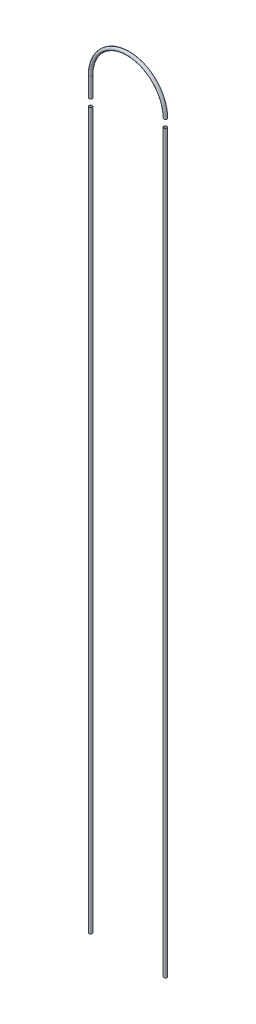
ISO-10303-21;
HEADER;
FILE_DESCRIPTION(('STEP AP214'),'2;1');
FILE_NAME('part.step','',(''),(''),'','','');
FILE_SCHEMA(('AUTOMOTIVE_DESIGN { 1 0 10303 214 1 1 1 1 }'));
ENDSEC;
DATA;
#1=APPLICATION_CONTEXT('core data for automotive mechanical design processes');
#2=APPLICATION_PROTOCOL_DEFINITION('international standard','automotive_design',2000,#1);
#3=PRODUCT_CONTEXT('',#1,'mechanical');
#4=PRODUCT('Part','Part','',(#3));
#5=PRODUCT_RELATED_PRODUCT_CATEGORY('part','',(#4));
#6=PRODUCT_DEFINITION_FORMATION('','',#4);
#7=PRODUCT_DEFINITION_CONTEXT('part definition',#1,'design');
#8=PRODUCT_DEFINITION('design','',#6,#7);
#9=PRODUCT_DEFINITION_SHAPE('','',#8);
#10=(LENGTH_UNIT() NAMED_UNIT(*) SI_UNIT(.MILLI.,.METRE.));
#11=(NAMED_UNIT(*) PLANE_ANGLE_UNIT() SI_UNIT($,.RADIAN.));
#12=(NAMED_UNIT(*) SI_UNIT($,.STERADIAN.) SOLID_ANGLE_UNIT());
#13=UNCERTAINTY_MEASURE_WITH_UNIT(LENGTH_MEASURE(1.E-05),#10,'distance_accuracy_value','');
#14=(GEOMETRIC_REPRESENTATION_CONTEXT(3) GLOBAL_UNCERTAINTY_ASSIGNED_CONTEXT((#13)) GLOBAL_UNIT_ASSIGNED_CONTEXT((#10,
#11,#12)) REPRESENTATION_CONTEXT('',''));
#15=CARTESIAN_POINT('',(0.,0.,0.));
#16=DIRECTION('',(0.,0.,1.));
#17=DIRECTION('',(1.,0.,0.));
#18=AXIS2_PLACEMENT_3D('',#15,#16,#17);
#19=CARTESIAN_POINT('',(-23039.4013918719,11026.3486481047,40208.3753071264));
#20=DIRECTION('',(0.,-1.,0.));
#21=DIRECTION('',(0.,0.,-1.));
#22=AXIS2_PLACEMENT_3D('',#19,#20,#21);
#23=PLANE('',#22);
#24=CARTESIAN_POINT('',(-23039.4013918719,11026.3486481047,40208.3753071264));
#25=DIRECTION('',(0.,-1.,0.));
#26=DIRECTION('',(0.,0.,-1.));
#27=AXIS2_PLACEMENT_3D('',#24,#25,#26);
#28=CIRCLE('',#27,27.0000000000011);
#29=CARTESIAN_POINT('',(-23039.4013918719,11026.3486481047,40181.3753071264));
#30=VERTEX_POINT('',#29);
#31=EDGE_CURVE('E82',#30,#30,#28,.T.);
#32=ORIENTED_EDGE('',*,*,#31,.T.);
#33=EDGE_LOOP('',(#32));
#34=FACE_BOUND('',#33,.T.);
#35=CARTESIAN_POINT('',(-23039.4013918719,11026.3486481047,40208.3753071264));
#36=DIRECTION('',(0.,-1.,0.));
#37=DIRECTION('',(0.,0.,-1.));
#38=AXIS2_PLACEMENT_3D('',#35,#36,#37);
#39=CIRCLE('',#38,30.0000000000011);
#40=CARTESIAN_POINT('',(-23039.4013918719,11026.3486481047,40178.3753071264));
#41=VERTEX_POINT('',#40);
#42=EDGE_CURVE('E74',#41,#41,#39,.T.);
#43=ORIENTED_EDGE('',*,*,#42,.F.);
#44=EDGE_LOOP('',(#43));
#45=FACE_BOUND('',#44,.T.);
#46=ADVANCED_FACE('F68',(#34,#45),#23,.F.);
#47=CARTESIAN_POINT('',(-23039.4013918719,-2173.6513518953,40208.3753071264));
#48=DIRECTION('',(0.,-1.,0.));
#49=DIRECTION('',(0.,0.,-1.));
#50=AXIS2_PLACEMENT_3D('',#47,#48,#49);
#51=PLANE('',#50);
#52=CARTESIAN_POINT('',(-23039.4013918719,-2173.6513518953,40208.3753071264));
#53=DIRECTION('',(0.,-1.,0.));
#54=DIRECTION('',(0.,0.,-1.));
#55=AXIS2_PLACEMENT_3D('',#52,#53,#54);
#56=CIRCLE('',#55,27.0000000000011);
#57=CARTESIAN_POINT('',(-23039.4013918719,-2173.6513518953,40181.3753071264));
#58=VERTEX_POINT('',#57);
#59=EDGE_CURVE('E78',#58,#58,#56,.T.);
#60=ORIENTED_EDGE('',*,*,#59,.F.);
#61=EDGE_LOOP('',(#60));
#62=FACE_BOUND('',#61,.T.);
#63=CARTESIAN_POINT('',(-23039.4013918719,-2173.6513518953,40208.3753071264));
#64=DIRECTION('',(0.,-1.,0.));
#65=DIRECTION('',(0.,0.,-1.));
#66=AXIS2_PLACEMENT_3D('',#63,#64,#65);
#67=CIRCLE('',#66,30.0000000000011);
#68=CARTESIAN_POINT('',(-23039.4013918719,-2173.6513518953,40178.3753071264));
#69=VERTEX_POINT('',#68);
#70=EDGE_CURVE('E12',#69,#69,#67,.T.);
#71=ORIENTED_EDGE('',*,*,#70,.T.);
#72=EDGE_LOOP('',(#71));
#73=FACE_BOUND('',#72,.T.);
#74=ADVANCED_FACE('F98',(#62,#73),#51,.T.);
#75=CARTESIAN_POINT('',(-23039.4013918719,11026.3486481047,40208.3753071264));
#76=DIRECTION('',(0.,-1.,0.));
#77=DIRECTION('',(0.,0.,-1.));
#78=AXIS2_PLACEMENT_3D('',#75,#76,#77);
#79=CYLINDRICAL_SURFACE('',#78,30.0000000000011);
#80=ORIENTED_EDGE('',*,*,#70,.F.);
#81=EDGE_LOOP('',(#80));
#82=FACE_BOUND('',#81,.T.);
#83=ORIENTED_EDGE('',*,*,#42,.T.);
#84=EDGE_LOOP('',(#83));
#85=FACE_BOUND('',#84,.T.);
#86=ADVANCED_FACE('F92',(#82,#85),#79,.T.);
#87=CARTESIAN_POINT('',(-23039.4013918719,11026.3486481047,40208.3753071264));
#88=DIRECTION('',(0.,-1.,0.));
#89=DIRECTION('',(0.,0.,-1.));
#90=AXIS2_PLACEMENT_3D('',#87,#88,#89);
#91=CYLINDRICAL_SURFACE('',#90,27.0000000000011);
#92=ORIENTED_EDGE('',*,*,#59,.T.);
#93=EDGE_LOOP('',(#92));
#94=FACE_BOUND('',#93,.T.);
#95=ORIENTED_EDGE('',*,*,#31,.F.);
#96=EDGE_LOOP('',(#95));
#97=FACE_BOUND('',#96,.T.);
#98=ADVANCED_FACE('F90',(#94,#97),#91,.F.);
#99=CLOSED_SHELL('',(#46,#74,#86,#98));
#100=MANIFOLD_SOLID_BREP('B2',#99);
#101=CARTESIAN_POINT('',(-21659.4013918008,11384.9457116641,40208.3753150977));
#102=DIRECTION('',(0.,-1.,0.));
#103=DIRECTION('',(0.,0.,-1.));
#104=AXIS2_PLACEMENT_3D('',#101,#102,#103);
#105=PLANE('',#104);
#106=CARTESIAN_POINT('',(-21659.4013918008,11384.9457116641,40208.3753150977));
#107=DIRECTION('',(0.,-1.,0.));
#108=DIRECTION('',(0.,0.,-1.));
#109=AXIS2_PLACEMENT_3D('',#106,#107,#108);
#110=CIRCLE('',#109,27.0000000000011);
#111=CARTESIAN_POINT('',(-21659.4013918008,11384.9457116641,40181.3753150977));
#112=VERTEX_POINT('',#111);
#113=EDGE_CURVE('E159',#112,#112,#110,.T.);
#114=ORIENTED_EDGE('',*,*,#113,.T.);
#115=EDGE_LOOP('',(#114));
#116=FACE_BOUND('',#115,.T.);
#117=CARTESIAN_POINT('',(-21659.4013918008,11384.9457116641,40208.3753150977));
#118=DIRECTION('',(0.,-1.,0.));
#119=DIRECTION('',(0.,0.,-1.));
#120=AXIS2_PLACEMENT_3D('',#117,#118,#119);
#121=CIRCLE('',#120,30.0000000000011);
#122=CARTESIAN_POINT('',(-21659.4013918008,11384.9457116641,40178.3753150977));
#123=VERTEX_POINT('',#122);
#124=EDGE_CURVE('E151',#123,#123,#121,.T.);
#125=ORIENTED_EDGE('',*,*,#124,.F.);
#126=EDGE_LOOP('',(#125));
#127=FACE_BOUND('',#126,.T.);
#128=ADVANCED_FACE('F145',(#116,#127),#105,.F.);
#129=CARTESIAN_POINT('',(-21659.4013918008,-2185.05428833593,40208.3753150977));
#130=DIRECTION('',(0.,-1.,0.));
#131=DIRECTION('',(0.,0.,-1.));
#132=AXIS2_PLACEMENT_3D('',#129,#130,#131);
#133=PLANE('',#132);
#134=CARTESIAN_POINT('',(-21659.4013918008,-2185.05428833593,40208.3753150977));
#135=DIRECTION('',(0.,-1.,0.));
#136=DIRECTION('',(0.,0.,-1.));
#137=AXIS2_PLACEMENT_3D('',#134,#135,#136);
#138=CIRCLE('',#137,27.0000000000011);
#139=CARTESIAN_POINT('',(-21659.4013918008,-2185.05428833593,40181.3753150977));
#140=VERTEX_POINT('',#139);
#141=EDGE_CURVE('E155',#140,#140,#138,.T.);
#142=ORIENTED_EDGE('',*,*,#141,.F.);
#143=EDGE_LOOP('',(#142));
#144=FACE_BOUND('',#143,.T.);
#145=CARTESIAN_POINT('',(-21659.4013918008,-2185.05428833593,40208.3753150977));
#146=DIRECTION('',(0.,-1.,0.));
#147=DIRECTION('',(0.,0.,-1.));
#148=AXIS2_PLACEMENT_3D('',#145,#146,#147);
#149=CIRCLE('',#148,30.0000000000011);
#150=CARTESIAN_POINT('',(-21659.4013918008,-2185.05428833593,40178.3753150977));
#151=VERTEX_POINT('',#150);
#152=EDGE_CURVE('E67',#151,#151,#149,.T.);
#153=ORIENTED_EDGE('',*,*,#152,.T.);
#154=EDGE_LOOP('',(#153));
#155=FACE_BOUND('',#154,.T.);
#156=ADVANCED_FACE('F175',(#144,#155),#133,.T.);
#157=CARTESIAN_POINT('',(-21659.4013918008,11384.9457116641,40208.3753150977));
#158=DIRECTION('',(0.,-1.,0.));
#159=DIRECTION('',(0.,0.,-1.));
#160=AXIS2_PLACEMENT_3D('',#157,#158,#159);
#161=CYLINDRICAL_SURFACE('',#160,30.0000000000011);
#162=ORIENTED_EDGE('',*,*,#152,.F.);
#163=EDGE_LOOP('',(#162));
#164=FACE_BOUND('',#163,.T.);
#165=ORIENTED_EDGE('',*,*,#124,.T.);
#166=EDGE_LOOP('',(#165));
#167=FACE_BOUND('',#166,.T.);
#168=ADVANCED_FACE('F169',(#164,#167),#161,.T.);
#169=CARTESIAN_POINT('',(-21659.4013918008,11384.9457116641,40208.3753150977));
#170=DIRECTION('',(0.,-1.,0.));
#171=DIRECTION('',(0.,0.,-1.));
#172=AXIS2_PLACEMENT_3D('',#169,#170,#171);
#173=CYLINDRICAL_SURFACE('',#172,27.0000000000011);
#174=ORIENTED_EDGE('',*,*,#141,.T.);
#175=EDGE_LOOP('',(#174));
#176=FACE_BOUND('',#175,.T.);
#177=ORIENTED_EDGE('',*,*,#113,.F.);
#178=EDGE_LOOP('',(#177));
#179=FACE_BOUND('',#178,.T.);
#180=ADVANCED_FACE('F167',(#176,#179),#173,.F.);
#181=CLOSED_SHELL('',(#128,#156,#168,#180));
#182=MANIFOLD_SOLID_BREP('B7',#181);
#183=CARTESIAN_POINT('',(-23039.4013918008,11163.1904121863,40208.3753150977));
#184=DIRECTION('',(0.,-1.,0.));
#185=DIRECTION('',(1.,0.,0.));
#186=AXIS2_PLACEMENT_3D('',#183,#184,#185);
#187=PLANE('',#186);
#188=CARTESIAN_POINT('',(-23039.4013918008,11163.1904121863,40208.3753150977));
#189=DIRECTION('',(0.,-1.,0.));
#190=DIRECTION('',(1.,0.,0.));
#191=AXIS2_PLACEMENT_3D('',#188,#189,#190);
#192=CIRCLE('',#191,27.0000000000011);
#193=CARTESIAN_POINT('',(-23012.4013918008,11163.1904121863,40208.3753150977));
#194=VERTEX_POINT('',#193);
#195=EDGE_CURVE('E235',#194,#194,#192,.T.);
#196=ORIENTED_EDGE('',*,*,#195,.F.);
#197=EDGE_LOOP('',(#196));
#198=FACE_BOUND('',#197,.T.);
#199=CARTESIAN_POINT('',(-23039.4013918008,11163.1904121863,40208.3753150977));
#200=DIRECTION('',(0.,-1.,0.));
#201=DIRECTION('',(1.,0.,0.));
#202=AXIS2_PLACEMENT_3D('',#199,#200,#201);
#203=CIRCLE('',#202,30.0000000000011);
#204=CARTESIAN_POINT('',(-23009.4013918008,11163.1904121863,40208.3753150977));
#205=VERTEX_POINT('',#204);
#206=EDGE_CURVE('E225',#205,#205,#203,.T.);
#207=ORIENTED_EDGE('',*,*,#206,.T.);
#208=EDGE_LOOP('',(#207));
#209=FACE_BOUND('',#208,.T.);
#210=ADVANCED_FACE('F215',(#198,#209),#187,.T.);
#211=CARTESIAN_POINT('',(-21659.4013918008,11528.5306285524,40208.3753150977));
#212=DIRECTION('',(0.,1.,0.));
#213=DIRECTION('',(-1.,0.,0.));
#214=AXIS2_PLACEMENT_3D('',#211,#212,#213);
#215=PLANE('',#214);
#216=CARTESIAN_POINT('',(-21659.4013918008,11528.5306285524,40208.3753150977));
#217=DIRECTION('',(0.,1.,0.));
#218=DIRECTION('',(-1.,0.,0.));
#219=AXIS2_PLACEMENT_3D('',#216,#217,#218);
#220=CIRCLE('',#219,27.0000000000011);
#221=CARTESIAN_POINT('',(-21632.4013918008,11528.5306285524,40208.3753150977));
#222=VERTEX_POINT('',#221);
#223=EDGE_CURVE('E229',#222,#222,#220,.T.);
#224=ORIENTED_EDGE('',*,*,#223,.T.);
#225=EDGE_LOOP('',(#224));
#226=FACE_BOUND('',#225,.T.);
#227=CARTESIAN_POINT('',(-21659.4013918008,11528.5306285524,40208.3753150977));
#228=DIRECTION('',(0.,1.,0.));
#229=DIRECTION('',(-1.,0.,0.));
#230=AXIS2_PLACEMENT_3D('',#227,#228,#229);
#231=CIRCLE('',#230,30.0000000000011);
#232=CARTESIAN_POINT('',(-21629.4013918008,11528.5306285524,40208.3753150977));
#233=VERTEX_POINT('',#232);
#234=EDGE_CURVE('E144',#233,#233,#231,.T.);
#235=ORIENTED_EDGE('',*,*,#234,.F.);
#236=EDGE_LOOP('',(#235));
#237=FACE_BOUND('',#236,.T.);
#238=ADVANCED_FACE('F252',(#226,#237),#215,.F.);
#239=CARTESIAN_POINT('',(-23039.4013918008,11163.1904121863,40208.3753150977));
#240=DIRECTION('',(0.,1.,0.));
#241=DIRECTION('',(0.,0.,1.));
#242=AXIS2_PLACEMENT_3D('',#239,#240,#241);
#243=CYLINDRICAL_SURFACE('',#242,30.0000000000011);
#244=CARTESIAN_POINT('',(-23039.4013918008,11528.5306285524,40208.3753150977));
#245=DIRECTION('',(0.,-1.,0.));
#246=DIRECTION('',(1.,0.,0.));
#247=AXIS2_PLACEMENT_3D('',#244,#245,#246);
#248=CIRCLE('',#247,30.0000000000011);
#249=CARTESIAN_POINT('',(-23069.4013918008,11528.5306285524,40208.3753150977));
#250=VERTEX_POINT('',#249);
#251=EDGE_CURVE('E221',#250,#250,#248,.T.);
#252=ORIENTED_EDGE('',*,*,#251,.T.);
#253=EDGE_LOOP('',(#252));
#254=FACE_BOUND('',#253,.T.);
#255=ORIENTED_EDGE('',*,*,#206,.F.);
#256=EDGE_LOOP('',(#255));
#257=FACE_BOUND('',#256,.T.);
#258=ADVANCED_FACE('F255',(#254,#257),#243,.T.);
#259=CARTESIAN_POINT('',(-22349.4013918008,11528.5306285524,40208.3753150977));
#260=DIRECTION('',(0.,0.,-1.));
#261=DIRECTION('',(-1.,0.,0.));
#262=AXIS2_PLACEMENT_3D('',#259,#260,#261);
#263=TOROIDAL_SURFACE('',#262,690.000000000001,30.0000000000011);
#264=CARTESIAN_POINT('',(-22349.4013918008,11528.5306285524,40208.3753150977));
#265=DIRECTION('',(0.,0.,-1.));
#266=DIRECTION('',(-1.,0.,0.));
#267=AXIS2_PLACEMENT_3D('',#264,#265,#266);
#268=CIRCLE('',#267,720.000000000002);
#269=EDGE_CURVE('',#250,#233,#268,.T.);
#270=ORIENTED_EDGE('',*,*,#251,.F.);
#271=ORIENTED_EDGE('',*,*,#234,.T.);
#272=ORIENTED_EDGE('',*,*,#269,.T.);
#273=ORIENTED_EDGE('',*,*,#269,.F.);
#274=EDGE_LOOP('',(#270,#272,#271,#273));
#275=FACE_BOUND('',#274,.T.);
#276=ADVANCED_FACE('F246',(#275),#263,.T.);
#277=CARTESIAN_POINT('',(-23039.4013918008,11163.1904121863,40208.3753150977));
#278=DIRECTION('',(0.,1.,0.));
#279=DIRECTION('',(0.,0.,1.));
#280=AXIS2_PLACEMENT_3D('',#277,#278,#279);
#281=CYLINDRICAL_SURFACE('',#280,27.0000000000011);
#282=CARTESIAN_POINT('',(-23039.4013918008,11528.5306285524,40208.3753150977));
#283=DIRECTION('',(0.,1.,0.));
#284=DIRECTION('',(0.,0.,1.));
#285=AXIS2_PLACEMENT_3D('',#282,#283,#284);
#286=CIRCLE('',#285,27.0000000000011);
#287=CARTESIAN_POINT('',(-23066.4013918008,11528.5306285524,40208.3753150977));
#288=VERTEX_POINT('',#287);
#289=EDGE_CURVE('E234',#288,#288,#286,.F.);
#290=ORIENTED_EDGE('',*,*,#289,.F.);
#291=EDGE_LOOP('',(#290));
#292=FACE_BOUND('',#291,.T.);
#293=ORIENTED_EDGE('',*,*,#195,.T.);
#294=EDGE_LOOP('',(#293));
#295=FACE_BOUND('',#294,.T.);
#296=ADVANCED_FACE('F243',(#292,#295),#281,.F.);
#297=CARTESIAN_POINT('',(-22349.4013918008,11528.5306285524,40208.3753150977));
#298=DIRECTION('',(0.,0.,-1.));
#299=DIRECTION('',(-1.,0.,0.));
#300=AXIS2_PLACEMENT_3D('',#297,#298,#299);
#301=TOROIDAL_SURFACE('',#300,690.000000000001,27.0000000000011);
#302=CARTESIAN_POINT('',(-22349.4013918008,11528.5306285524,40208.3753150977));
#303=DIRECTION('',(0.,0.,-1.));
#304=DIRECTION('',(-1.,0.,0.));
#305=AXIS2_PLACEMENT_3D('',#302,#303,#304);
#306=CIRCLE('',#305,717.000000000002);
#307=EDGE_CURVE('',#288,#222,#306,.T.);
#308=ORIENTED_EDGE('',*,*,#289,.T.);
#309=ORIENTED_EDGE('',*,*,#223,.F.);
#310=ORIENTED_EDGE('',*,*,#307,.T.);
#311=ORIENTED_EDGE('',*,*,#307,.F.);
#312=EDGE_LOOP('',(#308,#310,#309,#311));
#313=FACE_BOUND('',#312,.T.);
#314=ADVANCED_FACE('F241',(#313),#301,.F.);
#315=CLOSED_SHELL('',(#210,#238,#258,#276,#296,#314));
#316=MANIFOLD_SOLID_BREP('B62',#315);
#317=ADVANCED_BREP_SHAPE_REPRESENTATION('',(#18,#100,#182,#316),#14);
#318=SHAPE_DEFINITION_REPRESENTATION(#9,#317);
ENDSEC;
END-ISO-10303-21;
